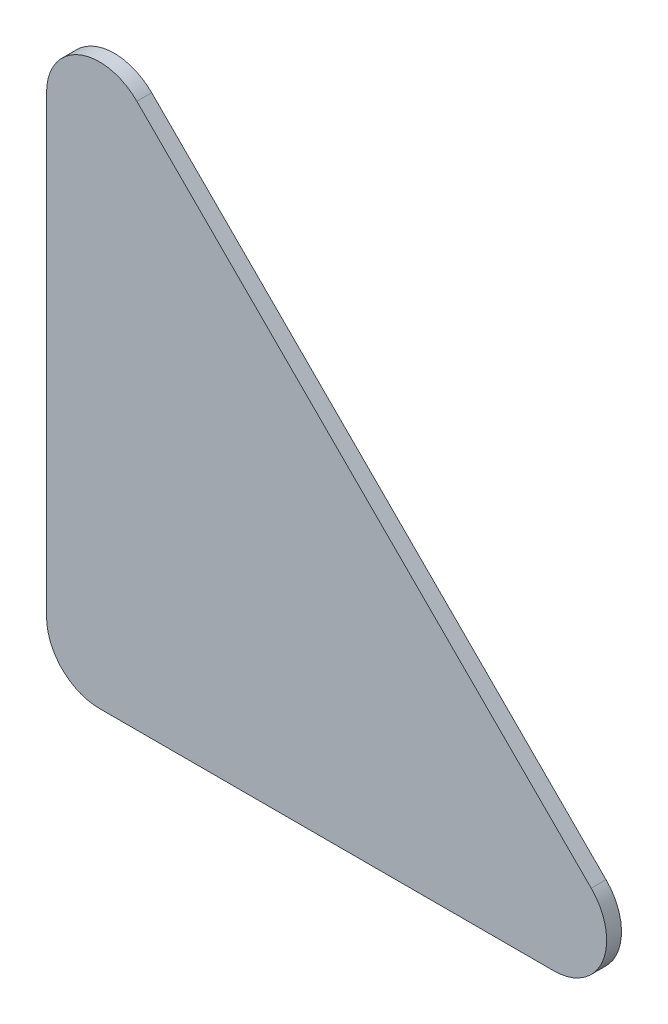
ISO-10303-21;
HEADER;
FILE_DESCRIPTION(('STEP AP214'),'2;1');
FILE_NAME('part.step','',(''),(''),'','','');
FILE_SCHEMA(('AUTOMOTIVE_DESIGN { 1 0 10303 214 1 1 1 1 }'));
ENDSEC;
DATA;
#1=APPLICATION_CONTEXT('core data for automotive mechanical design processes');
#2=APPLICATION_PROTOCOL_DEFINITION('international standard','automotive_design',2000,#1);
#3=PRODUCT_CONTEXT('',#1,'mechanical');
#4=PRODUCT('Part','Part','',(#3));
#5=PRODUCT_RELATED_PRODUCT_CATEGORY('part','',(#4));
#6=PRODUCT_DEFINITION_FORMATION('','',#4);
#7=PRODUCT_DEFINITION_CONTEXT('part definition',#1,'design');
#8=PRODUCT_DEFINITION('design','',#6,#7);
#9=PRODUCT_DEFINITION_SHAPE('','',#8);
#10=(LENGTH_UNIT() NAMED_UNIT(*) SI_UNIT(.MILLI.,.METRE.));
#11=(NAMED_UNIT(*) PLANE_ANGLE_UNIT() SI_UNIT($,.RADIAN.));
#12=(NAMED_UNIT(*) SI_UNIT($,.STERADIAN.) SOLID_ANGLE_UNIT());
#13=UNCERTAINTY_MEASURE_WITH_UNIT(LENGTH_MEASURE(1.E-05),#10,'distance_accuracy_value','');
#14=(GEOMETRIC_REPRESENTATION_CONTEXT(3) GLOBAL_UNCERTAINTY_ASSIGNED_CONTEXT((#13)) GLOBAL_UNIT_ASSIGNED_CONTEXT((#10,
#11,#12)) REPRESENTATION_CONTEXT('',''));
#15=CARTESIAN_POINT('',(0.,0.,0.));
#16=DIRECTION('',(0.,0.,1.));
#17=DIRECTION('',(1.,0.,0.));
#18=AXIS2_PLACEMENT_3D('',#15,#16,#17);
#19=CARTESIAN_POINT('',(30.,0.,-0.7));
#20=DIRECTION('',(0.,-1.,0.));
#21=DIRECTION('',(1.,0.,0.));
#22=AXIS2_PLACEMENT_3D('',#19,#20,#21);
#23=PLANE('',#22);
#24=DIRECTION('',(1.,0.,0.));
#25=VECTOR('',#24,1.);
#26=CARTESIAN_POINT('',(30.,0.,0.));
#27=LINE('',#26,#25);
#28=CARTESIAN_POINT('',(2.499,0.,0.));
#29=VERTEX_POINT('',#28);
#30=CARTESIAN_POINT('',(23.9668803076296,0.,0.));
#31=VERTEX_POINT('',#30);
#32=EDGE_CURVE('E146',#29,#31,#27,.T.);
#33=ORIENTED_EDGE('',*,*,#32,.F.);
#34=DIRECTION('',(0.,0.,1.));
#35=VECTOR('',#34,1.);
#36=CARTESIAN_POINT('',(2.499,0.,-0.7));
#37=LINE('',#36,#35);
#38=CARTESIAN_POINT('',(2.499,0.,-0.7));
#39=VERTEX_POINT('',#38);
#40=EDGE_CURVE('E131',#29,#39,#37,.F.);
#41=ORIENTED_EDGE('',*,*,#40,.T.);
#42=DIRECTION('',(1.,0.,0.));
#43=VECTOR('',#42,1.);
#44=CARTESIAN_POINT('',(30.,0.,-0.7));
#45=LINE('',#44,#43);
#46=CARTESIAN_POINT('',(23.9668803076296,0.,-0.7));
#47=VERTEX_POINT('',#46);
#48=EDGE_CURVE('E114',#39,#47,#45,.T.);
#49=ORIENTED_EDGE('',*,*,#48,.T.);
#50=DIRECTION('',(0.,0.,1.));
#51=VECTOR('',#50,1.);
#52=CARTESIAN_POINT('',(23.9668803076296,0.,-0.7));
#53=LINE('',#52,#51);
#54=EDGE_CURVE('E128',#47,#31,#53,.T.);
#55=ORIENTED_EDGE('',*,*,#54,.T.);
#56=EDGE_LOOP('',(#33,#41,#49,#55));
#57=FACE_BOUND('',#56,.T.);
#58=ADVANCED_FACE('F40',(#57),#23,.T.);
#59=CARTESIAN_POINT('',(0.,0.,-0.7));
#60=DIRECTION('',(-1.,0.,0.));
#61=DIRECTION('',(0.,0.,1.));
#62=AXIS2_PLACEMENT_3D('',#59,#60,#61);
#63=PLANE('',#62);
#64=DIRECTION('',(0.,-1.,0.));
#65=VECTOR('',#64,1.);
#66=CARTESIAN_POINT('',(0.,0.,-0.7));
#67=LINE('',#66,#65);
#68=CARTESIAN_POINT('',(0.,23.9668803076296,-0.7));
#69=VERTEX_POINT('',#68);
#70=CARTESIAN_POINT('',(0.,2.499,-0.7));
#71=VERTEX_POINT('',#70);
#72=EDGE_CURVE('E117',#69,#71,#67,.T.);
#73=ORIENTED_EDGE('',*,*,#72,.T.);
#74=DIRECTION('',(0.,0.,1.));
#75=VECTOR('',#74,1.);
#76=CARTESIAN_POINT('',(0.,2.499,-0.7));
#77=LINE('',#76,#75);
#78=CARTESIAN_POINT('',(0.,2.499,0.));
#79=VERTEX_POINT('',#78);
#80=EDGE_CURVE('E112',#71,#79,#77,.T.);
#81=ORIENTED_EDGE('',*,*,#80,.T.);
#82=DIRECTION('',(0.,-1.,0.));
#83=VECTOR('',#82,1.);
#84=CARTESIAN_POINT('',(0.,0.,0.));
#85=LINE('',#84,#83);
#86=CARTESIAN_POINT('',(0.,23.9668803076296,0.));
#87=VERTEX_POINT('',#86);
#88=EDGE_CURVE('E97',#87,#79,#85,.T.);
#89=ORIENTED_EDGE('',*,*,#88,.F.);
#90=DIRECTION('',(0.,0.,1.));
#91=VECTOR('',#90,1.);
#92=CARTESIAN_POINT('',(0.,23.9668803076296,-0.7));
#93=LINE('',#92,#91);
#94=EDGE_CURVE('E110',#87,#69,#93,.F.);
#95=ORIENTED_EDGE('',*,*,#94,.T.);
#96=EDGE_LOOP('',(#73,#81,#89,#95));
#97=FACE_BOUND('',#96,.T.);
#98=ADVANCED_FACE('F109',(#97),#63,.T.);
#99=CARTESIAN_POINT('',(0.,30.,-0.7));
#100=DIRECTION('',(0.707106781186548,0.707106781186548,0.));
#101=DIRECTION('',(-0.707106781186548,0.707106781186548,0.));
#102=AXIS2_PLACEMENT_3D('',#99,#100,#101);
#103=PLANE('',#102);
#104=DIRECTION('',(-0.707106781186547,0.707106781186547,0.));
#105=VECTOR('',#104,1.);
#106=CARTESIAN_POINT('',(0.,30.,-0.7));
#107=LINE('',#106,#105);
#108=CARTESIAN_POINT('',(25.7339401538148,4.26605984618518,-0.7));
#109=VERTEX_POINT('',#108);
#110=CARTESIAN_POINT('',(4.26605984618518,25.7339401538148,-0.7));
#111=VERTEX_POINT('',#110);
#112=EDGE_CURVE('E120',#109,#111,#107,.T.);
#113=ORIENTED_EDGE('',*,*,#112,.T.);
#114=DIRECTION('',(0.,0.,1.));
#115=VECTOR('',#114,1.);
#116=CARTESIAN_POINT('',(4.26605984618518,25.7339401538148,-0.7));
#117=LINE('',#116,#115);
#118=CARTESIAN_POINT('',(4.26605984618518,25.7339401538148,0.));
#119=VERTEX_POINT('',#118);
#120=EDGE_CURVE('E12',#111,#119,#117,.T.);
#121=ORIENTED_EDGE('',*,*,#120,.T.);
#122=DIRECTION('',(-0.707106781186547,0.707106781186547,0.));
#123=VECTOR('',#122,1.);
#124=CARTESIAN_POINT('',(0.,30.,0.));
#125=LINE('',#124,#123);
#126=CARTESIAN_POINT('',(25.7339401538148,4.26605984618518,0.));
#127=VERTEX_POINT('',#126);
#128=EDGE_CURVE('E98',#127,#119,#125,.T.);
#129=ORIENTED_EDGE('',*,*,#128,.F.);
#130=DIRECTION('',(0.,0.,1.));
#131=VECTOR('',#130,1.);
#132=CARTESIAN_POINT('',(25.7339401538148,4.26605984618518,-0.7));
#133=LINE('',#132,#131);
#134=EDGE_CURVE('E48',#127,#109,#133,.F.);
#135=ORIENTED_EDGE('',*,*,#134,.T.);
#136=EDGE_LOOP('',(#113,#121,#129,#135));
#137=FACE_BOUND('',#136,.T.);
#138=ADVANCED_FACE('F159',(#137),#103,.T.);
#139=CARTESIAN_POINT('',(0.,0.,-0.7));
#140=DIRECTION('',(0.,0.,-1.));
#141=DIRECTION('',(-1.,0.,0.));
#142=AXIS2_PLACEMENT_3D('',#139,#140,#141);
#143=PLANE('',#142);
#144=ORIENTED_EDGE('',*,*,#48,.F.);
#145=CARTESIAN_POINT('',(2.499,2.499,-0.7));
#146=DIRECTION('',(0.,0.,-1.));
#147=DIRECTION('',(-1.,0.,0.));
#148=AXIS2_PLACEMENT_3D('',#145,#146,#147);
#149=CIRCLE('',#148,2.499);
#150=EDGE_CURVE('E136',#39,#71,#149,.T.);
#151=ORIENTED_EDGE('',*,*,#150,.T.);
#152=ORIENTED_EDGE('',*,*,#72,.F.);
#153=CARTESIAN_POINT('',(2.499,23.9668803076296,-0.7));
#154=DIRECTION('',(0.,0.,-1.));
#155=DIRECTION('',(-1.,0.,0.));
#156=AXIS2_PLACEMENT_3D('',#153,#154,#155);
#157=CIRCLE('',#156,2.499);
#158=EDGE_CURVE('E55',#69,#111,#157,.T.);
#159=ORIENTED_EDGE('',*,*,#158,.T.);
#160=ORIENTED_EDGE('',*,*,#112,.F.);
#161=CARTESIAN_POINT('',(23.9668803076296,2.499,-0.7));
#162=DIRECTION('',(0.,0.,-1.));
#163=DIRECTION('',(-1.,0.,0.));
#164=AXIS2_PLACEMENT_3D('',#161,#162,#163);
#165=CIRCLE('',#164,2.499);
#166=EDGE_CURVE('E133',#109,#47,#165,.T.);
#167=ORIENTED_EDGE('',*,*,#166,.T.);
#168=EDGE_LOOP('',(#144,#151,#152,#159,#160,#167));
#169=FACE_BOUND('',#168,.T.);
#170=ADVANCED_FACE('F139',(#169),#143,.T.);
#171=CARTESIAN_POINT('',(0.,0.,0.));
#172=DIRECTION('',(0.,0.,-1.));
#173=DIRECTION('',(-1.,0.,0.));
#174=AXIS2_PLACEMENT_3D('',#171,#172,#173);
#175=PLANE('',#174);
#176=ORIENTED_EDGE('',*,*,#88,.T.);
#177=CARTESIAN_POINT('',(2.499,2.499,0.));
#178=DIRECTION('',(0.,0.,-1.));
#179=DIRECTION('',(-1.,0.,0.));
#180=AXIS2_PLACEMENT_3D('',#177,#178,#179);
#181=CIRCLE('',#180,2.499);
#182=EDGE_CURVE('E103',#79,#29,#181,.F.);
#183=ORIENTED_EDGE('',*,*,#182,.T.);
#184=ORIENTED_EDGE('',*,*,#32,.T.);
#185=CARTESIAN_POINT('',(23.9668803076296,2.499,0.));
#186=DIRECTION('',(0.,0.,-1.));
#187=DIRECTION('',(-1.,0.,0.));
#188=AXIS2_PLACEMENT_3D('',#185,#186,#187);
#189=CIRCLE('',#188,2.499);
#190=EDGE_CURVE('E104',#31,#127,#189,.F.);
#191=ORIENTED_EDGE('',*,*,#190,.T.);
#192=ORIENTED_EDGE('',*,*,#128,.T.);
#193=CARTESIAN_POINT('',(2.499,23.9668803076296,0.));
#194=DIRECTION('',(0.,0.,-1.));
#195=DIRECTION('',(-1.,0.,0.));
#196=AXIS2_PLACEMENT_3D('',#193,#194,#195);
#197=CIRCLE('',#196,2.499);
#198=EDGE_CURVE('E94',#119,#87,#197,.F.);
#199=ORIENTED_EDGE('',*,*,#198,.T.);
#200=EDGE_LOOP('',(#176,#183,#184,#191,#192,#199));
#201=FACE_BOUND('',#200,.T.);
#202=ADVANCED_FACE('F96',(#201),#175,.F.);
#203=CARTESIAN_POINT('',(2.499,2.499,-0.7));
#204=DIRECTION('',(0.,0.,1.));
#205=DIRECTION('',(1.,0.,0.));
#206=AXIS2_PLACEMENT_3D('',#203,#204,#205);
#207=CYLINDRICAL_SURFACE('',#206,2.499);
#208=ORIENTED_EDGE('',*,*,#150,.F.);
#209=ORIENTED_EDGE('',*,*,#40,.F.);
#210=ORIENTED_EDGE('',*,*,#182,.F.);
#211=ORIENTED_EDGE('',*,*,#80,.F.);
#212=EDGE_LOOP('',(#208,#209,#210,#211));
#213=FACE_BOUND('',#212,.T.);
#214=ADVANCED_FACE('F143',(#213),#207,.T.);
#215=CARTESIAN_POINT('',(2.499,23.9668803076296,-0.7));
#216=DIRECTION('',(0.,0.,1.));
#217=DIRECTION('',(1.,0.,0.));
#218=AXIS2_PLACEMENT_3D('',#215,#216,#217);
#219=CYLINDRICAL_SURFACE('',#218,2.499);
#220=ORIENTED_EDGE('',*,*,#158,.F.);
#221=ORIENTED_EDGE('',*,*,#94,.F.);
#222=ORIENTED_EDGE('',*,*,#198,.F.);
#223=ORIENTED_EDGE('',*,*,#120,.F.);
#224=EDGE_LOOP('',(#220,#221,#222,#223));
#225=FACE_BOUND('',#224,.T.);
#226=ADVANCED_FACE('F116',(#225),#219,.T.);
#227=CARTESIAN_POINT('',(23.9668803076296,2.499,-0.7));
#228=DIRECTION('',(0.,0.,1.));
#229=DIRECTION('',(1.,0.,0.));
#230=AXIS2_PLACEMENT_3D('',#227,#228,#229);
#231=CYLINDRICAL_SURFACE('',#230,2.499);
#232=ORIENTED_EDGE('',*,*,#166,.F.);
#233=ORIENTED_EDGE('',*,*,#134,.F.);
#234=ORIENTED_EDGE('',*,*,#190,.F.);
#235=ORIENTED_EDGE('',*,*,#54,.F.);
#236=EDGE_LOOP('',(#232,#233,#234,#235));
#237=FACE_BOUND('',#236,.T.);
#238=ADVANCED_FACE('F42',(#237),#231,.T.);
#239=CLOSED_SHELL('',(#58,#98,#138,#170,#202,#214,#226,#238));
#240=MANIFOLD_SOLID_BREP('B2',#239);
#241=ADVANCED_BREP_SHAPE_REPRESENTATION('',(#18,#240),#14);
#242=SHAPE_DEFINITION_REPRESENTATION(#9,#241);
ENDSEC;
END-ISO-10303-21;
